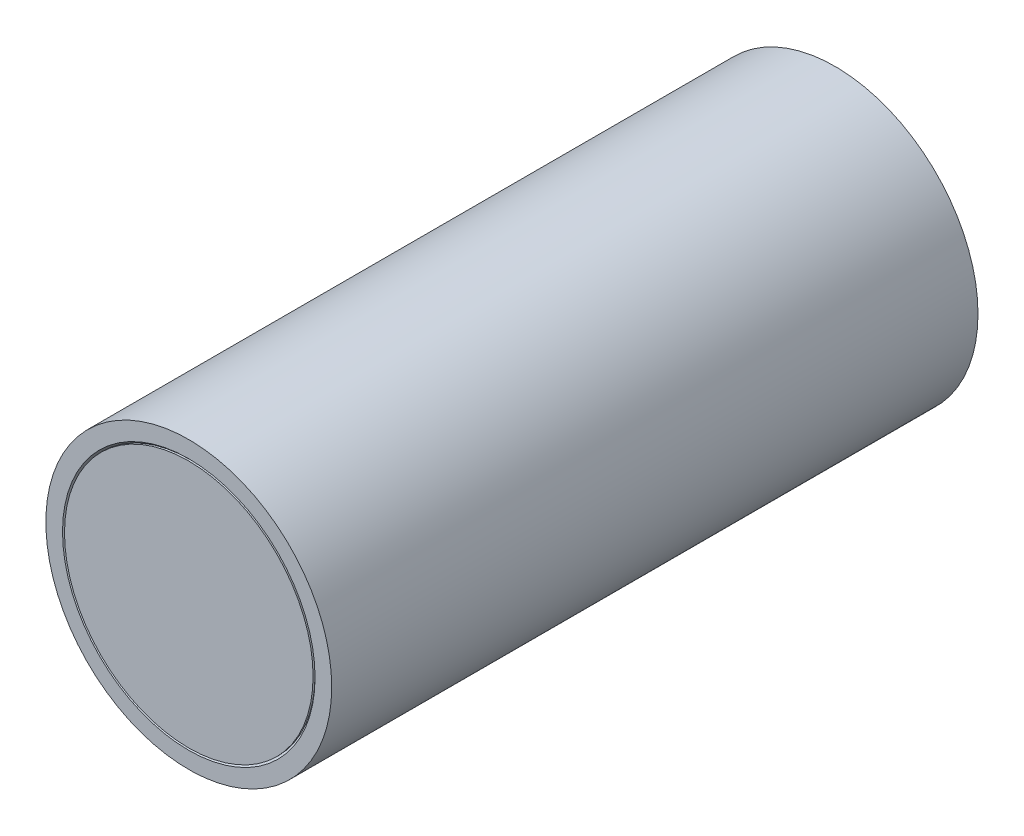
ISO-10303-21;
HEADER;
FILE_DESCRIPTION(('STEP AP214'),'2;1');
FILE_NAME('part.step','',(''),(''),'','','');
FILE_SCHEMA(('AUTOMOTIVE_DESIGN { 1 0 10303 214 1 1 1 1 }'));
ENDSEC;
DATA;
#1=APPLICATION_CONTEXT('core data for automotive mechanical design processes');
#2=APPLICATION_PROTOCOL_DEFINITION('international standard','automotive_design',2000,#1);
#3=PRODUCT_CONTEXT('',#1,'mechanical');
#4=PRODUCT('Part','Part','',(#3));
#5=PRODUCT_RELATED_PRODUCT_CATEGORY('part','',(#4));
#6=PRODUCT_DEFINITION_FORMATION('','',#4);
#7=PRODUCT_DEFINITION_CONTEXT('part definition',#1,'design');
#8=PRODUCT_DEFINITION('design','',#6,#7);
#9=PRODUCT_DEFINITION_SHAPE('','',#8);
#10=(LENGTH_UNIT() NAMED_UNIT(*) SI_UNIT(.MILLI.,.METRE.));
#11=(NAMED_UNIT(*) PLANE_ANGLE_UNIT() SI_UNIT($,.RADIAN.));
#12=(NAMED_UNIT(*) SI_UNIT($,.STERADIAN.) SOLID_ANGLE_UNIT());
#13=UNCERTAINTY_MEASURE_WITH_UNIT(LENGTH_MEASURE(1.E-05),#10,'distance_accuracy_value','');
#14=(GEOMETRIC_REPRESENTATION_CONTEXT(3) GLOBAL_UNCERTAINTY_ASSIGNED_CONTEXT((#13)) GLOBAL_UNIT_ASSIGNED_CONTEXT((#10,
#11,#12)) REPRESENTATION_CONTEXT('',''));
#15=CARTESIAN_POINT('',(0.,0.,0.));
#16=DIRECTION('',(0.,0.,1.));
#17=DIRECTION('',(1.,0.,0.));
#18=AXIS2_PLACEMENT_3D('',#15,#16,#17);
#19=CARTESIAN_POINT('',(0.,0.,165.1));
#20=DIRECTION('',(0.,0.,-1.));
#21=DIRECTION('',(-1.,0.,0.));
#22=AXIS2_PLACEMENT_3D('',#19,#20,#21);
#23=CYLINDRICAL_SURFACE('',#22,31.75);
#24=CARTESIAN_POINT('',(0.,0.,165.1));
#25=DIRECTION('',(0.,0.,1.));
#26=DIRECTION('',(1.,0.,0.));
#27=AXIS2_PLACEMENT_3D('',#24,#25,#26);
#28=CIRCLE('',#27,31.75);
#29=CARTESIAN_POINT('',(31.75,0.,165.1));
#30=VERTEX_POINT('',#29);
#31=EDGE_CURVE('E11',#30,#30,#28,.T.);
#32=ORIENTED_EDGE('',*,*,#31,.F.);
#33=EDGE_LOOP('',(#32));
#34=FACE_BOUND('',#33,.T.);
#35=CARTESIAN_POINT('',(0.,0.,0.));
#36=DIRECTION('',(0.,0.,1.));
#37=DIRECTION('',(1.,0.,0.));
#38=AXIS2_PLACEMENT_3D('',#35,#36,#37);
#39=CIRCLE('',#38,31.75);
#40=CARTESIAN_POINT('',(31.75,0.,0.));
#41=VERTEX_POINT('',#40);
#42=EDGE_CURVE('E48',#41,#41,#39,.T.);
#43=ORIENTED_EDGE('',*,*,#42,.T.);
#44=EDGE_LOOP('',(#43));
#45=FACE_BOUND('',#44,.T.);
#46=ADVANCED_FACE('F45',(#34,#45),#23,.T.);
#47=CARTESIAN_POINT('',(0.,0.,165.1));
#48=DIRECTION('',(0.,0.,1.));
#49=DIRECTION('',(1.,0.,0.));
#50=AXIS2_PLACEMENT_3D('',#47,#48,#49);
#51=PLANE('',#50);
#52=ORIENTED_EDGE('',*,*,#31,.T.);
#53=EDGE_LOOP('',(#52));
#54=FACE_BOUND('',#53,.T.);
#55=ADVANCED_FACE('F60',(#54),#51,.T.);
#56=CARTESIAN_POINT('',(0.,0.,0.));
#57=DIRECTION('',(0.,0.,1.));
#58=DIRECTION('',(1.,0.,0.));
#59=AXIS2_PLACEMENT_3D('',#56,#57,#58);
#60=PLANE('',#59);
#61=ORIENTED_EDGE('',*,*,#42,.F.);
#62=EDGE_LOOP('',(#61));
#63=FACE_BOUND('',#62,.T.);
#64=ADVANCED_FACE('F58',(#63),#60,.F.);
#65=CLOSED_SHELL('',(#46,#55,#64));
#66=MANIFOLD_SOLID_BREP('B2',#65);
#67=CARTESIAN_POINT('',(0.,0.,165.1));
#68=DIRECTION('',(0.,0.,1.));
#69=DIRECTION('',(1.,0.,0.));
#70=AXIS2_PLACEMENT_3D('',#67,#68,#69);
#71=PLANE('',#70);
#72=CARTESIAN_POINT('',(0.,0.,165.1));
#73=DIRECTION('',(0.,0.,1.));
#74=DIRECTION('',(1.,0.,0.));
#75=AXIS2_PLACEMENT_3D('',#72,#73,#74);
#76=CIRCLE('',#75,32.258);
#77=CARTESIAN_POINT('',(32.258,0.,165.1));
#78=VERTEX_POINT('',#77);
#79=EDGE_CURVE('E93',#78,#78,#76,.F.);
#80=ORIENTED_EDGE('',*,*,#79,.T.);
#81=EDGE_LOOP('',(#80));
#82=FACE_BOUND('',#81,.T.);
#83=CARTESIAN_POINT('',(0.,0.,165.1));
#84=DIRECTION('',(0.,0.,1.));
#85=DIRECTION('',(1.,0.,0.));
#86=AXIS2_PLACEMENT_3D('',#83,#84,#85);
#87=CIRCLE('',#86,36.5125);
#88=CARTESIAN_POINT('',(36.5125,0.,165.1));
#89=VERTEX_POINT('',#88);
#90=EDGE_CURVE('E106',#89,#89,#87,.T.);
#91=ORIENTED_EDGE('',*,*,#90,.T.);
#92=EDGE_LOOP('',(#91));
#93=FACE_BOUND('',#92,.T.);
#94=ADVANCED_FACE('F86',(#82,#93),#71,.T.);
#95=CARTESIAN_POINT('',(0.,0.,0.));
#96=DIRECTION('',(0.,0.,1.));
#97=DIRECTION('',(1.,0.,0.));
#98=AXIS2_PLACEMENT_3D('',#95,#96,#97);
#99=PLANE('',#98);
#100=CARTESIAN_POINT('',(0.,0.,0.));
#101=DIRECTION('',(0.,0.,1.));
#102=DIRECTION('',(1.,0.,0.));
#103=AXIS2_PLACEMENT_3D('',#100,#101,#102);
#104=CIRCLE('',#103,32.258);
#105=CARTESIAN_POINT('',(32.258,0.,0.));
#106=VERTEX_POINT('',#105);
#107=EDGE_CURVE('E44',#106,#106,#104,.T.);
#108=ORIENTED_EDGE('',*,*,#107,.T.);
#109=EDGE_LOOP('',(#108));
#110=FACE_BOUND('',#109,.T.);
#111=CARTESIAN_POINT('',(0.,0.,0.));
#112=DIRECTION('',(0.,0.,1.));
#113=DIRECTION('',(1.,0.,0.));
#114=AXIS2_PLACEMENT_3D('',#111,#112,#113);
#115=CIRCLE('',#114,36.5125);
#116=CARTESIAN_POINT('',(36.5125,0.,0.));
#117=VERTEX_POINT('',#116);
#118=EDGE_CURVE('E107',#117,#117,#115,.T.);
#119=ORIENTED_EDGE('',*,*,#118,.F.);
#120=EDGE_LOOP('',(#119));
#121=FACE_BOUND('',#120,.T.);
#122=ADVANCED_FACE('F118',(#110,#121),#99,.F.);
#123=CARTESIAN_POINT('',(0.,0.,165.1));
#124=DIRECTION('',(0.,0.,-1.));
#125=DIRECTION('',(-1.,0.,0.));
#126=AXIS2_PLACEMENT_3D('',#123,#124,#125);
#127=CYLINDRICAL_SURFACE('',#126,36.5125);
#128=ORIENTED_EDGE('',*,*,#90,.F.);
#129=EDGE_LOOP('',(#128));
#130=FACE_BOUND('',#129,.T.);
#131=ORIENTED_EDGE('',*,*,#118,.T.);
#132=EDGE_LOOP('',(#131));
#133=FACE_BOUND('',#132,.T.);
#134=ADVANCED_FACE('F114',(#130,#133),#127,.T.);
#135=CARTESIAN_POINT('',(0.,0.,165.1));
#136=DIRECTION('',(0.,0.,-1.));
#137=DIRECTION('',(-1.,0.,0.));
#138=AXIS2_PLACEMENT_3D('',#135,#136,#137);
#139=CYLINDRICAL_SURFACE('',#138,31.75);
#140=CARTESIAN_POINT('',(0.,0.,164.592));
#141=DIRECTION('',(0.,0.,1.));
#142=DIRECTION('',(1.,0.,0.));
#143=AXIS2_PLACEMENT_3D('',#140,#141,#142);
#144=CIRCLE('',#143,31.75);
#145=CARTESIAN_POINT('',(31.75,0.,164.592));
#146=VERTEX_POINT('',#145);
#147=EDGE_CURVE('E97',#146,#146,#144,.T.);
#148=ORIENTED_EDGE('',*,*,#147,.T.);
#149=EDGE_LOOP('',(#148));
#150=FACE_BOUND('',#149,.T.);
#151=CARTESIAN_POINT('',(0.,0.,0.508000000000008));
#152=DIRECTION('',(0.,0.,1.));
#153=DIRECTION('',(1.,0.,0.));
#154=AXIS2_PLACEMENT_3D('',#151,#152,#153);
#155=CIRCLE('',#154,31.75);
#156=CARTESIAN_POINT('',(31.75,0.,0.508000000000008));
#157=VERTEX_POINT('',#156);
#158=EDGE_CURVE('E101',#157,#157,#155,.F.);
#159=ORIENTED_EDGE('',*,*,#158,.T.);
#160=EDGE_LOOP('',(#159));
#161=FACE_BOUND('',#160,.T.);
#162=ADVANCED_FACE('F117',(#150,#161),#139,.F.);
#163=CARTESIAN_POINT('',(0.,0.,164.592));
#164=DIRECTION('',(0.,0.,1.));
#165=DIRECTION('',(1.,0.,0.));
#166=AXIS2_PLACEMENT_3D('',#163,#164,#165);
#167=CONICAL_SURFACE('',#166,31.75,0.785398163397448);
#168=ORIENTED_EDGE('',*,*,#79,.F.);
#169=EDGE_LOOP('',(#168));
#170=FACE_BOUND('',#169,.T.);
#171=ORIENTED_EDGE('',*,*,#147,.F.);
#172=EDGE_LOOP('',(#171));
#173=FACE_BOUND('',#172,.T.);
#174=ADVANCED_FACE('F129',(#170,#173),#167,.F.);
#175=CARTESIAN_POINT('',(0.,0.,0.));
#176=DIRECTION('',(0.,0.,-1.));
#177=DIRECTION('',(-1.,0.,0.));
#178=AXIS2_PLACEMENT_3D('',#175,#176,#177);
#179=CONICAL_SURFACE('',#178,32.258,0.785398163397448);
#180=ORIENTED_EDGE('',*,*,#158,.F.);
#181=EDGE_LOOP('',(#180));
#182=FACE_BOUND('',#181,.T.);
#183=ORIENTED_EDGE('',*,*,#107,.F.);
#184=EDGE_LOOP('',(#183));
#185=FACE_BOUND('',#184,.T.);
#186=ADVANCED_FACE('F88',(#182,#185),#179,.F.);
#187=CLOSED_SHELL('',(#94,#122,#134,#162,#174,#186));
#188=MANIFOLD_SOLID_BREP('B6',#187);
#189=ADVANCED_BREP_SHAPE_REPRESENTATION('',(#18,#66,#188),#14);
#190=SHAPE_DEFINITION_REPRESENTATION(#9,#189);
ENDSEC;
END-ISO-10303-21;
